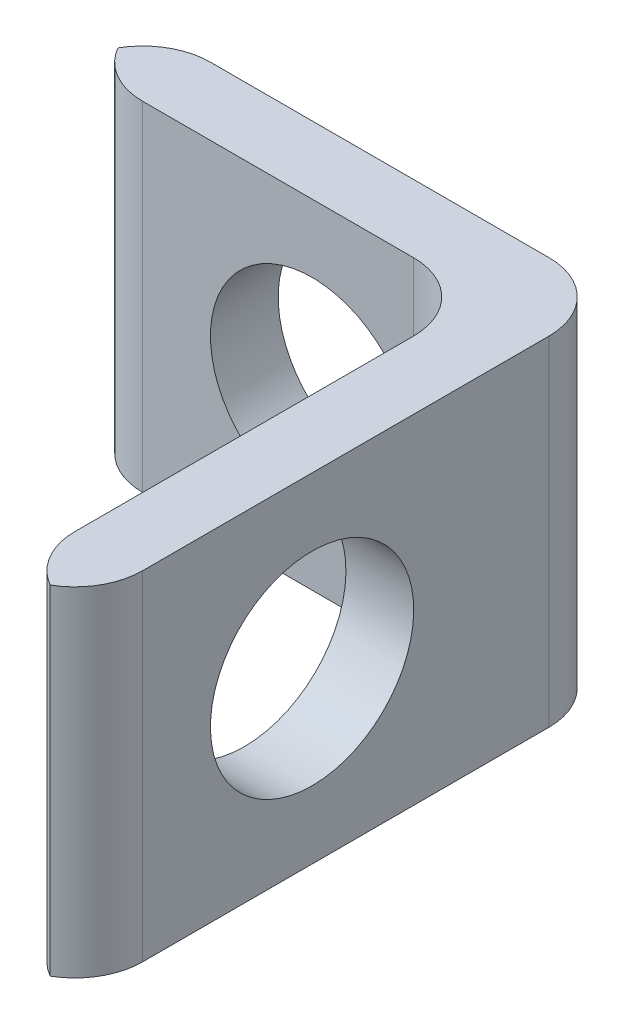
ISO-10303-21;
HEADER;
FILE_DESCRIPTION(('STEP AP214'),'2;1');
FILE_NAME('part.step','',(''),(''),'','','');
FILE_SCHEMA(('AUTOMOTIVE_DESIGN { 1 0 10303 214 1 1 1 1 }'));
ENDSEC;
DATA;
#1=APPLICATION_CONTEXT('core data for automotive mechanical design processes');
#2=APPLICATION_PROTOCOL_DEFINITION('international standard','automotive_design',2000,#1);
#3=PRODUCT_CONTEXT('',#1,'mechanical');
#4=PRODUCT('Part','Part','',(#3));
#5=PRODUCT_RELATED_PRODUCT_CATEGORY('part','',(#4));
#6=PRODUCT_DEFINITION_FORMATION('','',#4);
#7=PRODUCT_DEFINITION_CONTEXT('part definition',#1,'design');
#8=PRODUCT_DEFINITION('design','',#6,#7);
#9=PRODUCT_DEFINITION_SHAPE('','',#8);
#10=(LENGTH_UNIT() NAMED_UNIT(*) SI_UNIT(.MILLI.,.METRE.));
#11=(NAMED_UNIT(*) PLANE_ANGLE_UNIT() SI_UNIT($,.RADIAN.));
#12=(NAMED_UNIT(*) SI_UNIT($,.STERADIAN.) SOLID_ANGLE_UNIT());
#13=UNCERTAINTY_MEASURE_WITH_UNIT(LENGTH_MEASURE(1.E-05),#10,'distance_accuracy_value','');
#14=(GEOMETRIC_REPRESENTATION_CONTEXT(3) GLOBAL_UNCERTAINTY_ASSIGNED_CONTEXT((#13)) GLOBAL_UNIT_ASSIGNED_CONTEXT((#10,
#11,#12)) REPRESENTATION_CONTEXT('',''));
#15=CARTESIAN_POINT('',(0.,0.,0.));
#16=DIRECTION('',(0.,0.,1.));
#17=DIRECTION('',(1.,0.,0.));
#18=AXIS2_PLACEMENT_3D('',#15,#16,#17);
#19=CARTESIAN_POINT('',(0.,0.,1.));
#20=DIRECTION('',(0.,0.,-1.));
#21=DIRECTION('',(-1.,0.,0.));
#22=AXIS2_PLACEMENT_3D('',#19,#20,#21);
#23=PLANE('',#22);
#24=DIRECTION('',(-1.,0.,0.));
#25=VECTOR('',#24,1.);
#26=CARTESIAN_POINT('',(0.,5.,1.));
#27=LINE('',#26,#25);
#28=CARTESIAN_POINT('',(5.,5.,1.));
#29=VERTEX_POINT('',#28);
#30=CARTESIAN_POINT('',(1.,5.,1.));
#31=VERTEX_POINT('',#30);
#32=EDGE_CURVE('E231',#29,#31,#27,.T.);
#33=ORIENTED_EDGE('',*,*,#32,.T.);
#34=DIRECTION('',(0.,-1.,0.));
#35=VECTOR('',#34,1.);
#36=CARTESIAN_POINT('',(1.,0.,1.));
#37=LINE('',#36,#35);
#38=CARTESIAN_POINT('',(1.,0.,1.));
#39=VERTEX_POINT('',#38);
#40=EDGE_CURVE('E197',#31,#39,#37,.T.);
#41=ORIENTED_EDGE('',*,*,#40,.T.);
#42=DIRECTION('',(1.,0.,0.));
#43=VECTOR('',#42,1.);
#44=CARTESIAN_POINT('',(0.,0.,1.));
#45=LINE('',#44,#43);
#46=CARTESIAN_POINT('',(5.,0.,1.));
#47=VERTEX_POINT('',#46);
#48=EDGE_CURVE('E234',#39,#47,#45,.T.);
#49=ORIENTED_EDGE('',*,*,#48,.T.);
#50=DIRECTION('',(0.,-1.,0.));
#51=VECTOR('',#50,1.);
#52=CARTESIAN_POINT('',(5.,5.,1.));
#53=LINE('',#52,#51);
#54=CARTESIAN_POINT('',(5.,2.5,1.));
#55=VERTEX_POINT('',#54);
#56=EDGE_CURVE('E144',#47,#55,#53,.F.);
#57=ORIENTED_EDGE('',*,*,#56,.T.);
#58=CARTESIAN_POINT('',(3.5,2.5,1.));
#59=DIRECTION('',(0.,0.,1.));
#60=DIRECTION('',(1.,0.,0.));
#61=AXIS2_PLACEMENT_3D('',#58,#59,#60);
#62=CIRCLE('',#61,1.5);
#63=EDGE_CURVE('E242',#55,#55,#62,.T.);
#64=ORIENTED_EDGE('',*,*,#63,.F.);
#65=DIRECTION('',(0.,-1.,0.));
#66=VECTOR('',#65,1.);
#67=CARTESIAN_POINT('',(5.,5.,1.));
#68=LINE('',#67,#66);
#69=EDGE_CURVE('E152',#55,#29,#68,.F.);
#70=ORIENTED_EDGE('',*,*,#69,.T.);
#71=EDGE_LOOP('',(#33,#41,#49,#57,#64,#70));
#72=FACE_BOUND('',#71,.T.);
#73=ADVANCED_FACE('F43',(#72),#23,.F.);
#74=CARTESIAN_POINT('',(0.,0.,0.));
#75=DIRECTION('',(0.,0.,-1.));
#76=DIRECTION('',(-1.,0.,0.));
#77=AXIS2_PLACEMENT_3D('',#74,#75,#76);
#78=PLANE('',#77);
#79=DIRECTION('',(-1.,0.,0.));
#80=VECTOR('',#79,1.);
#81=CARTESIAN_POINT('',(0.,5.,0.));
#82=LINE('',#81,#80);
#83=CARTESIAN_POINT('',(6.,5.,0.));
#84=VERTEX_POINT('',#83);
#85=CARTESIAN_POINT('',(1.,5.,0.));
#86=VERTEX_POINT('',#85);
#87=EDGE_CURVE('E237',#84,#86,#82,.T.);
#88=ORIENTED_EDGE('',*,*,#87,.F.);
#89=DIRECTION('',(0.,1.,0.));
#90=VECTOR('',#89,1.);
#91=CARTESIAN_POINT('',(6.,0.,0.));
#92=LINE('',#91,#90);
#93=CARTESIAN_POINT('',(6.,0.,0.));
#94=VERTEX_POINT('',#93);
#95=EDGE_CURVE('E52',#84,#94,#92,.F.);
#96=ORIENTED_EDGE('',*,*,#95,.T.);
#97=DIRECTION('',(1.,0.,0.));
#98=VECTOR('',#97,1.);
#99=CARTESIAN_POINT('',(0.,0.,0.));
#100=LINE('',#99,#98);
#101=CARTESIAN_POINT('',(1.,0.,0.));
#102=VERTEX_POINT('',#101);
#103=EDGE_CURVE('E240',#102,#94,#100,.T.);
#104=ORIENTED_EDGE('',*,*,#103,.F.);
#105=DIRECTION('',(0.,-1.,0.));
#106=VECTOR('',#105,1.);
#107=CARTESIAN_POINT('',(1.,5.,0.));
#108=LINE('',#107,#106);
#109=EDGE_CURVE('E201',#102,#86,#108,.F.);
#110=ORIENTED_EDGE('',*,*,#109,.T.);
#111=EDGE_LOOP('',(#88,#96,#104,#110));
#112=FACE_BOUND('',#111,.T.);
#113=CARTESIAN_POINT('',(3.5,2.5,0.));
#114=DIRECTION('',(0.,0.,1.));
#115=DIRECTION('',(1.,0.,0.));
#116=AXIS2_PLACEMENT_3D('',#113,#114,#115);
#117=CIRCLE('',#116,1.5);
#118=CARTESIAN_POINT('',(5.,2.5,0.));
#119=VERTEX_POINT('',#118);
#120=EDGE_CURVE('E246',#119,#119,#117,.T.);
#121=ORIENTED_EDGE('',*,*,#120,.T.);
#122=EDGE_LOOP('',(#121));
#123=FACE_BOUND('',#122,.T.);
#124=ADVANCED_FACE('F278',(#112,#123),#78,.T.);
#125=CARTESIAN_POINT('',(0.,0.,1.));
#126=DIRECTION('',(0.,1.,0.));
#127=DIRECTION('',(0.,0.,1.));
#128=AXIS2_PLACEMENT_3D('',#125,#126,#127);
#129=PLANE('',#128);
#130=ORIENTED_EDGE('',*,*,#103,.T.);
#131=CARTESIAN_POINT('',(6.,0.,1.));
#132=DIRECTION('',(0.,1.,0.));
#133=DIRECTION('',(0.,0.,1.));
#134=AXIS2_PLACEMENT_3D('',#131,#132,#133);
#135=CIRCLE('',#134,1.);
#136=CARTESIAN_POINT('',(7.,0.,1.));
#137=VERTEX_POINT('',#136);
#138=EDGE_CURVE('E11',#94,#137,#135,.F.);
#139=ORIENTED_EDGE('',*,*,#138,.T.);
#140=DIRECTION('',(0.,0.,-1.));
#141=VECTOR('',#140,1.);
#142=CARTESIAN_POINT('',(7.,0.,1.));
#143=LINE('',#142,#141);
#144=CARTESIAN_POINT('',(7.,0.,7.));
#145=VERTEX_POINT('',#144);
#146=EDGE_CURVE('E153',#145,#137,#143,.T.);
#147=ORIENTED_EDGE('',*,*,#146,.F.);
#148=CARTESIAN_POINT('',(6.,0.,7.));
#149=DIRECTION('',(0.,1.,0.));
#150=DIRECTION('',(0.,0.,1.));
#151=AXIS2_PLACEMENT_3D('',#148,#149,#150);
#152=CIRCLE('',#151,1.);
#153=CARTESIAN_POINT('',(6.5,0.,7.86602540378444));
#154=VERTEX_POINT('',#153);
#155=EDGE_CURVE('E191',#145,#154,#152,.F.);
#156=ORIENTED_EDGE('',*,*,#155,.T.);
#157=CARTESIAN_POINT('',(7.,0.,7.));
#158=DIRECTION('',(0.,1.,0.));
#159=DIRECTION('',(0.,0.,1.));
#160=AXIS2_PLACEMENT_3D('',#157,#158,#159);
#161=CIRCLE('',#160,1.);
#162=CARTESIAN_POINT('',(6.,0.,7.));
#163=VERTEX_POINT('',#162);
#164=EDGE_CURVE('E130',#154,#163,#161,.F.);
#165=ORIENTED_EDGE('',*,*,#164,.T.);
#166=DIRECTION('',(0.,0.,-1.));
#167=VECTOR('',#166,1.);
#168=CARTESIAN_POINT('',(6.,0.,8.));
#169=LINE('',#168,#167);
#170=CARTESIAN_POINT('',(6.,0.,2.));
#171=VERTEX_POINT('',#170);
#172=EDGE_CURVE('E123',#163,#171,#169,.T.);
#173=ORIENTED_EDGE('',*,*,#172,.T.);
#174=CARTESIAN_POINT('',(5.,0.,2.));
#175=DIRECTION('',(0.,1.,0.));
#176=DIRECTION('',(0.,0.,1.));
#177=AXIS2_PLACEMENT_3D('',#174,#175,#176);
#178=CIRCLE('',#177,1.);
#179=EDGE_CURVE('E127',#171,#47,#178,.T.);
#180=ORIENTED_EDGE('',*,*,#179,.T.);
#181=ORIENTED_EDGE('',*,*,#48,.F.);
#182=CARTESIAN_POINT('',(1.,0.,0.));
#183=DIRECTION('',(0.,1.,0.));
#184=DIRECTION('',(0.,0.,1.));
#185=AXIS2_PLACEMENT_3D('',#182,#183,#184);
#186=CIRCLE('',#185,1.);
#187=CARTESIAN_POINT('',(0.133974596215561,0.,0.5));
#188=VERTEX_POINT('',#187);
#189=EDGE_CURVE('E186',#39,#188,#186,.F.);
#190=ORIENTED_EDGE('',*,*,#189,.T.);
#191=CARTESIAN_POINT('',(1.,0.,1.));
#192=DIRECTION('',(0.,1.,0.));
#193=DIRECTION('',(0.,0.,1.));
#194=AXIS2_PLACEMENT_3D('',#191,#192,#193);
#195=CIRCLE('',#194,1.);
#196=EDGE_CURVE('E183',#188,#102,#195,.F.);
#197=ORIENTED_EDGE('',*,*,#196,.T.);
#198=EDGE_LOOP('',(#130,#139,#147,#156,#165,#173,#180,#181,#190,#197));
#199=FACE_BOUND('',#198,.T.);
#200=ADVANCED_FACE('F125',(#199),#129,.F.);
#201=CARTESIAN_POINT('',(7.,0.,1.));
#202=DIRECTION('',(-1.,0.,0.));
#203=DIRECTION('',(0.,0.,1.));
#204=AXIS2_PLACEMENT_3D('',#201,#202,#203);
#205=PLANE('',#204);
#206=CARTESIAN_POINT('',(7.,2.5,4.5));
#207=DIRECTION('',(-1.,0.,0.));
#208=DIRECTION('',(0.,-1.,0.));
#209=AXIS2_PLACEMENT_3D('',#206,#207,#208);
#210=CIRCLE('',#209,1.5);
#211=CARTESIAN_POINT('',(7.,1.,4.5));
#212=VERTEX_POINT('',#211);
#213=EDGE_CURVE('E136',#212,#212,#210,.T.);
#214=ORIENTED_EDGE('',*,*,#213,.T.);
#215=EDGE_LOOP('',(#214));
#216=FACE_BOUND('',#215,.T.);
#217=ORIENTED_EDGE('',*,*,#146,.T.);
#218=DIRECTION('',(0.,1.,0.));
#219=VECTOR('',#218,1.);
#220=CARTESIAN_POINT('',(7.,5.,1.));
#221=LINE('',#220,#219);
#222=CARTESIAN_POINT('',(7.,5.,1.));
#223=VERTEX_POINT('',#222);
#224=EDGE_CURVE('E205',#137,#223,#221,.T.);
#225=ORIENTED_EDGE('',*,*,#224,.T.);
#226=DIRECTION('',(0.,0.,-1.));
#227=VECTOR('',#226,1.);
#228=CARTESIAN_POINT('',(7.,5.,1.));
#229=LINE('',#228,#227);
#230=CARTESIAN_POINT('',(7.,5.,7.));
#231=VERTEX_POINT('',#230);
#232=EDGE_CURVE('E159',#231,#223,#229,.T.);
#233=ORIENTED_EDGE('',*,*,#232,.F.);
#234=DIRECTION('',(0.,1.,0.));
#235=VECTOR('',#234,1.);
#236=CARTESIAN_POINT('',(7.,0.,7.));
#237=LINE('',#236,#235);
#238=EDGE_CURVE('E179',#231,#145,#237,.F.);
#239=ORIENTED_EDGE('',*,*,#238,.T.);
#240=EDGE_LOOP('',(#217,#225,#233,#239));
#241=FACE_BOUND('',#240,.T.);
#242=ADVANCED_FACE('F223',(#216,#241),#205,.F.);
#243=CARTESIAN_POINT('',(0.,5.,1.));
#244=DIRECTION('',(0.,-1.,0.));
#245=DIRECTION('',(0.,0.,-1.));
#246=AXIS2_PLACEMENT_3D('',#243,#244,#245);
#247=PLANE('',#246);
#248=ORIENTED_EDGE('',*,*,#232,.T.);
#249=CARTESIAN_POINT('',(6.,5.,1.));
#250=DIRECTION('',(0.,-1.,0.));
#251=DIRECTION('',(0.,0.,-1.));
#252=AXIS2_PLACEMENT_3D('',#249,#250,#251);
#253=CIRCLE('',#252,1.);
#254=EDGE_CURVE('E66',#223,#84,#253,.F.);
#255=ORIENTED_EDGE('',*,*,#254,.T.);
#256=ORIENTED_EDGE('',*,*,#87,.T.);
#257=CARTESIAN_POINT('',(1.,5.,1.));
#258=DIRECTION('',(0.,-1.,0.));
#259=DIRECTION('',(0.,0.,-1.));
#260=AXIS2_PLACEMENT_3D('',#257,#258,#259);
#261=CIRCLE('',#260,1.);
#262=CARTESIAN_POINT('',(0.133974596215561,5.,0.5));
#263=VERTEX_POINT('',#262);
#264=EDGE_CURVE('E167',#86,#263,#261,.F.);
#265=ORIENTED_EDGE('',*,*,#264,.T.);
#266=CARTESIAN_POINT('',(1.,5.,0.));
#267=DIRECTION('',(0.,-1.,0.));
#268=DIRECTION('',(0.,0.,-1.));
#269=AXIS2_PLACEMENT_3D('',#266,#267,#268);
#270=CIRCLE('',#269,1.);
#271=EDGE_CURVE('E170',#263,#31,#270,.F.);
#272=ORIENTED_EDGE('',*,*,#271,.T.);
#273=ORIENTED_EDGE('',*,*,#32,.F.);
#274=CARTESIAN_POINT('',(5.,5.,2.));
#275=DIRECTION('',(0.,-1.,0.));
#276=DIRECTION('',(0.,0.,-1.));
#277=AXIS2_PLACEMENT_3D('',#274,#275,#276);
#278=CIRCLE('',#277,1.);
#279=CARTESIAN_POINT('',(6.,5.,2.));
#280=VERTEX_POINT('',#279);
#281=EDGE_CURVE('E146',#29,#280,#278,.T.);
#282=ORIENTED_EDGE('',*,*,#281,.T.);
#283=DIRECTION('',(0.,0.,-1.));
#284=VECTOR('',#283,1.);
#285=CARTESIAN_POINT('',(6.,5.,8.));
#286=LINE('',#285,#284);
#287=CARTESIAN_POINT('',(6.,5.,7.));
#288=VERTEX_POINT('',#287);
#289=EDGE_CURVE('E135',#288,#280,#286,.T.);
#290=ORIENTED_EDGE('',*,*,#289,.F.);
#291=CARTESIAN_POINT('',(7.,5.,7.));
#292=DIRECTION('',(0.,-1.,0.));
#293=DIRECTION('',(0.,0.,-1.));
#294=AXIS2_PLACEMENT_3D('',#291,#292,#293);
#295=CIRCLE('',#294,1.);
#296=CARTESIAN_POINT('',(6.5,5.,7.86602540378444));
#297=VERTEX_POINT('',#296);
#298=EDGE_CURVE('E173',#288,#297,#295,.F.);
#299=ORIENTED_EDGE('',*,*,#298,.T.);
#300=CARTESIAN_POINT('',(6.,5.,7.));
#301=DIRECTION('',(0.,-1.,0.));
#302=DIRECTION('',(0.,0.,-1.));
#303=AXIS2_PLACEMENT_3D('',#300,#301,#302);
#304=CIRCLE('',#303,1.);
#305=EDGE_CURVE('E176',#297,#231,#304,.F.);
#306=ORIENTED_EDGE('',*,*,#305,.T.);
#307=EDGE_LOOP('',(#248,#255,#256,#265,#272,#273,#282,#290,#299,#306));
#308=FACE_BOUND('',#307,.T.);
#309=ADVANCED_FACE('F228',(#308),#247,.F.);
#310=CARTESIAN_POINT('',(3.5,2.5,1.));
#311=DIRECTION('',(0.,0.,-1.));
#312=DIRECTION('',(-1.,0.,0.));
#313=AXIS2_PLACEMENT_3D('',#310,#311,#312);
#314=CYLINDRICAL_SURFACE('',#313,1.5);
#315=ORIENTED_EDGE('',*,*,#63,.T.);
#316=EDGE_LOOP('',(#315));
#317=FACE_BOUND('',#316,.T.);
#318=ORIENTED_EDGE('',*,*,#120,.F.);
#319=EDGE_LOOP('',(#318));
#320=FACE_BOUND('',#319,.T.);
#321=ADVANCED_FACE('F270',(#317,#320),#314,.F.);
#322=CARTESIAN_POINT('',(6.,5.,8.));
#323=DIRECTION('',(1.,0.,0.));
#324=DIRECTION('',(0.,1.,0.));
#325=AXIS2_PLACEMENT_3D('',#322,#323,#324);
#326=PLANE('',#325);
#327=CARTESIAN_POINT('',(6.,2.5,4.5));
#328=DIRECTION('',(-1.,0.,0.));
#329=DIRECTION('',(0.,-1.,0.));
#330=AXIS2_PLACEMENT_3D('',#327,#328,#329);
#331=CIRCLE('',#330,1.5);
#332=CARTESIAN_POINT('',(6.,1.,4.5));
#333=VERTEX_POINT('',#332);
#334=EDGE_CURVE('E210',#333,#333,#331,.T.);
#335=ORIENTED_EDGE('',*,*,#334,.F.);
#336=EDGE_LOOP('',(#335));
#337=FACE_BOUND('',#336,.T.);
#338=ORIENTED_EDGE('',*,*,#172,.F.);
#339=DIRECTION('',(0.,-1.,0.));
#340=VECTOR('',#339,1.);
#341=CARTESIAN_POINT('',(6.,5.,7.));
#342=LINE('',#341,#340);
#343=EDGE_CURVE('E194',#163,#288,#342,.F.);
#344=ORIENTED_EDGE('',*,*,#343,.T.);
#345=ORIENTED_EDGE('',*,*,#289,.T.);
#346=DIRECTION('',(0.,-1.,0.));
#347=VECTOR('',#346,1.);
#348=CARTESIAN_POINT('',(6.,0.,2.));
#349=LINE('',#348,#347);
#350=EDGE_CURVE('E143',#280,#171,#349,.T.);
#351=ORIENTED_EDGE('',*,*,#350,.T.);
#352=EDGE_LOOP('',(#338,#344,#345,#351));
#353=FACE_BOUND('',#352,.T.);
#354=ADVANCED_FACE('F148',(#337,#353),#326,.F.);
#355=CARTESIAN_POINT('',(7.,2.5,4.5));
#356=DIRECTION('',(-1.,0.,0.));
#357=DIRECTION('',(0.,-1.,0.));
#358=AXIS2_PLACEMENT_3D('',#355,#356,#357);
#359=CYLINDRICAL_SURFACE('',#358,1.5);
#360=ORIENTED_EDGE('',*,*,#213,.F.);
#361=EDGE_LOOP('',(#360));
#362=FACE_BOUND('',#361,.T.);
#363=ORIENTED_EDGE('',*,*,#334,.T.);
#364=EDGE_LOOP('',(#363));
#365=FACE_BOUND('',#364,.T.);
#366=ADVANCED_FACE('F263',(#362,#365),#359,.F.);
#367=CARTESIAN_POINT('',(5.,5.,2.));
#368=DIRECTION('',(0.,1.,0.));
#369=DIRECTION('',(-1.,0.,0.));
#370=AXIS2_PLACEMENT_3D('',#367,#368,#369);
#371=CYLINDRICAL_SURFACE('',#370,1.);
#372=ORIENTED_EDGE('',*,*,#69,.F.);
#373=ORIENTED_EDGE('',*,*,#56,.F.);
#374=ORIENTED_EDGE('',*,*,#179,.F.);
#375=ORIENTED_EDGE('',*,*,#350,.F.);
#376=ORIENTED_EDGE('',*,*,#281,.F.);
#377=EDGE_LOOP('',(#372,#373,#374,#375,#376));
#378=FACE_BOUND('',#377,.T.);
#379=ADVANCED_FACE('F141',(#378),#371,.F.);
#380=CARTESIAN_POINT('',(7.,0.,7.));
#381=DIRECTION('',(0.,-1.,0.));
#382=DIRECTION('',(1.,0.,0.));
#383=AXIS2_PLACEMENT_3D('',#380,#381,#382);
#384=CYLINDRICAL_SURFACE('',#383,1.);
#385=ORIENTED_EDGE('',*,*,#343,.F.);
#386=ORIENTED_EDGE('',*,*,#164,.F.);
#387=DIRECTION('',(0.,-1.,0.));
#388=VECTOR('',#387,1.);
#389=CARTESIAN_POINT('',(6.5,2.5,7.86602540378444));
#390=LINE('',#389,#388);
#391=EDGE_CURVE('E206',#297,#154,#390,.T.);
#392=ORIENTED_EDGE('',*,*,#391,.F.);
#393=ORIENTED_EDGE('',*,*,#298,.F.);
#394=EDGE_LOOP('',(#385,#386,#392,#393));
#395=FACE_BOUND('',#394,.T.);
#396=ADVANCED_FACE('F294',(#395),#384,.T.);
#397=CARTESIAN_POINT('',(6.,0.,7.));
#398=DIRECTION('',(0.,1.,0.));
#399=DIRECTION('',(0.,0.,1.));
#400=AXIS2_PLACEMENT_3D('',#397,#398,#399);
#401=CYLINDRICAL_SURFACE('',#400,1.);
#402=ORIENTED_EDGE('',*,*,#155,.F.);
#403=ORIENTED_EDGE('',*,*,#238,.F.);
#404=ORIENTED_EDGE('',*,*,#305,.F.);
#405=ORIENTED_EDGE('',*,*,#391,.T.);
#406=EDGE_LOOP('',(#402,#403,#404,#405));
#407=FACE_BOUND('',#406,.T.);
#408=ADVANCED_FACE('F295',(#407),#401,.T.);
#409=CARTESIAN_POINT('',(1.,0.,1.));
#410=DIRECTION('',(0.,1.,0.));
#411=DIRECTION('',(0.,0.,1.));
#412=AXIS2_PLACEMENT_3D('',#409,#410,#411);
#413=CYLINDRICAL_SURFACE('',#412,1.);
#414=DIRECTION('',(0.,1.,0.));
#415=VECTOR('',#414,1.);
#416=CARTESIAN_POINT('',(0.133974596215561,2.5,0.5));
#417=LINE('',#416,#415);
#418=EDGE_CURVE('E211',#263,#188,#417,.F.);
#419=ORIENTED_EDGE('',*,*,#418,.F.);
#420=ORIENTED_EDGE('',*,*,#264,.F.);
#421=ORIENTED_EDGE('',*,*,#109,.F.);
#422=ORIENTED_EDGE('',*,*,#196,.F.);
#423=EDGE_LOOP('',(#419,#420,#421,#422));
#424=FACE_BOUND('',#423,.T.);
#425=ADVANCED_FACE('F298',(#424),#413,.T.);
#426=CARTESIAN_POINT('',(1.,0.,0.));
#427=DIRECTION('',(0.,-1.,0.));
#428=DIRECTION('',(0.,0.,-1.));
#429=AXIS2_PLACEMENT_3D('',#426,#427,#428);
#430=CYLINDRICAL_SURFACE('',#429,1.);
#431=ORIENTED_EDGE('',*,*,#271,.F.);
#432=ORIENTED_EDGE('',*,*,#418,.T.);
#433=ORIENTED_EDGE('',*,*,#189,.F.);
#434=ORIENTED_EDGE('',*,*,#40,.F.);
#435=EDGE_LOOP('',(#431,#432,#433,#434));
#436=FACE_BOUND('',#435,.T.);
#437=ADVANCED_FACE('F303',(#436),#430,.T.);
#438=CARTESIAN_POINT('',(6.,0.,1.));
#439=DIRECTION('',(0.,-1.,0.));
#440=DIRECTION('',(0.,0.,-1.));
#441=AXIS2_PLACEMENT_3D('',#438,#439,#440);
#442=CYLINDRICAL_SURFACE('',#441,1.);
#443=ORIENTED_EDGE('',*,*,#138,.F.);
#444=ORIENTED_EDGE('',*,*,#95,.F.);
#445=ORIENTED_EDGE('',*,*,#254,.F.);
#446=ORIENTED_EDGE('',*,*,#224,.F.);
#447=EDGE_LOOP('',(#443,#444,#445,#446));
#448=FACE_BOUND('',#447,.T.);
#449=ADVANCED_FACE('F45',(#448),#442,.T.);
#450=CLOSED_SHELL('',(#73,#124,#200,#242,#309,#321,#354,#366,#379,#396,#408,#425,#437,#449));
#451=MANIFOLD_SOLID_BREP('B2',#450);
#452=ADVANCED_BREP_SHAPE_REPRESENTATION('',(#18,#451),#14);
#453=SHAPE_DEFINITION_REPRESENTATION(#9,#452);
ENDSEC;
END-ISO-10303-21;
